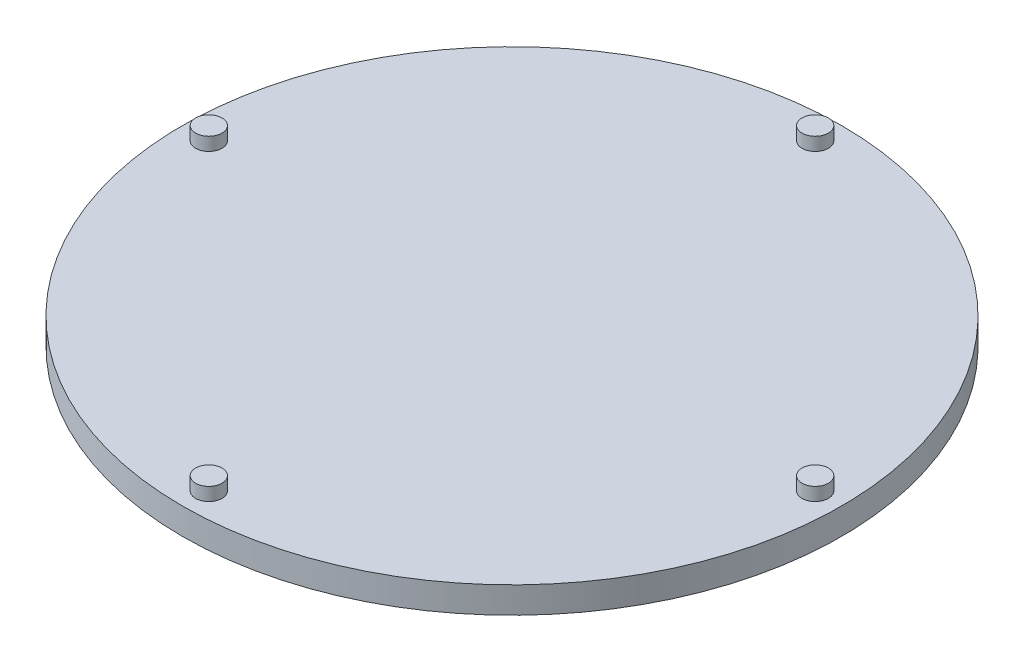
ISO-10303-21;
HEADER;
FILE_DESCRIPTION(('STEP AP214'),'2;1');
FILE_NAME('part.step','',(''),(''),'','','');
FILE_SCHEMA(('AUTOMOTIVE_DESIGN { 1 0 10303 214 1 1 1 1 }'));
ENDSEC;
DATA;
#1=APPLICATION_CONTEXT('core data for automotive mechanical design processes');
#2=APPLICATION_PROTOCOL_DEFINITION('international standard','automotive_design',2000,#1);
#3=PRODUCT_CONTEXT('',#1,'mechanical');
#4=PRODUCT('Part','Part','',(#3));
#5=PRODUCT_RELATED_PRODUCT_CATEGORY('part','',(#4));
#6=PRODUCT_DEFINITION_FORMATION('','',#4);
#7=PRODUCT_DEFINITION_CONTEXT('part definition',#1,'design');
#8=PRODUCT_DEFINITION('design','',#6,#7);
#9=PRODUCT_DEFINITION_SHAPE('','',#8);
#10=(LENGTH_UNIT() NAMED_UNIT(*) SI_UNIT(.MILLI.,.METRE.));
#11=(NAMED_UNIT(*) PLANE_ANGLE_UNIT() SI_UNIT($,.RADIAN.));
#12=(NAMED_UNIT(*) SI_UNIT($,.STERADIAN.) SOLID_ANGLE_UNIT());
#13=UNCERTAINTY_MEASURE_WITH_UNIT(LENGTH_MEASURE(1.E-05),#10,'distance_accuracy_value','');
#14=(GEOMETRIC_REPRESENTATION_CONTEXT(3) GLOBAL_UNCERTAINTY_ASSIGNED_CONTEXT((#13)) GLOBAL_UNIT_ASSIGNED_CONTEXT((#10,
#11,#12)) REPRESENTATION_CONTEXT('',''));
#15=CARTESIAN_POINT('',(0.,0.,0.));
#16=DIRECTION('',(0.,0.,1.));
#17=DIRECTION('',(1.,0.,0.));
#18=AXIS2_PLACEMENT_3D('',#15,#16,#17);
#19=CARTESIAN_POINT('',(0.,2.,0.));
#20=DIRECTION('',(0.,-1.,0.));
#21=DIRECTION('',(0.,0.,-1.));
#22=AXIS2_PLACEMENT_3D('',#19,#20,#21);
#23=CYLINDRICAL_SURFACE('',#22,25.);
#24=CARTESIAN_POINT('',(0.,2.,0.));
#25=DIRECTION('',(0.,1.,0.));
#26=DIRECTION('',(0.,0.,1.));
#27=AXIS2_PLACEMENT_3D('',#24,#25,#26);
#28=CIRCLE('',#27,25.);
#29=CARTESIAN_POINT('',(0.,2.,25.));
#30=VERTEX_POINT('',#29);
#31=EDGE_CURVE('E10',#30,#30,#28,.T.);
#32=ORIENTED_EDGE('',*,*,#31,.F.);
#33=EDGE_LOOP('',(#32));
#34=FACE_BOUND('',#33,.T.);
#35=CARTESIAN_POINT('',(0.,0.,0.));
#36=DIRECTION('',(0.,1.,0.));
#37=DIRECTION('',(0.,0.,1.));
#38=AXIS2_PLACEMENT_3D('',#35,#36,#37);
#39=CIRCLE('',#38,25.);
#40=CARTESIAN_POINT('',(0.,0.,25.));
#41=VERTEX_POINT('',#40);
#42=EDGE_CURVE('E33',#41,#41,#39,.T.);
#43=ORIENTED_EDGE('',*,*,#42,.T.);
#44=EDGE_LOOP('',(#43));
#45=FACE_BOUND('',#44,.T.);
#46=ADVANCED_FACE('F30',(#34,#45),#23,.T.);
#47=CARTESIAN_POINT('',(0.,2.,0.));
#48=DIRECTION('',(0.,1.,0.));
#49=DIRECTION('',(0.,0.,1.));
#50=AXIS2_PLACEMENT_3D('',#47,#48,#49);
#51=PLANE('',#50);
#52=CARTESIAN_POINT('',(-23.,2.,0.));
#53=DIRECTION('',(0.,1.,0.));
#54=DIRECTION('',(0.,0.,1.));
#55=AXIS2_PLACEMENT_3D('',#52,#53,#54);
#56=CIRCLE('',#55,1.);
#57=CARTESIAN_POINT('',(-23.,2.,1.));
#58=VERTEX_POINT('',#57);
#59=EDGE_CURVE('E60',#58,#58,#56,.T.);
#60=ORIENTED_EDGE('',*,*,#59,.F.);
#61=EDGE_LOOP('',(#60));
#62=FACE_BOUND('',#61,.T.);
#63=CARTESIAN_POINT('',(0.,2.,23.));
#64=DIRECTION('',(0.,1.,0.));
#65=DIRECTION('',(0.,0.,1.));
#66=AXIS2_PLACEMENT_3D('',#63,#64,#65);
#67=CIRCLE('',#66,1.);
#68=CARTESIAN_POINT('',(0.,2.,24.));
#69=VERTEX_POINT('',#68);
#70=EDGE_CURVE('E54',#69,#69,#67,.T.);
#71=ORIENTED_EDGE('',*,*,#70,.F.);
#72=EDGE_LOOP('',(#71));
#73=FACE_BOUND('',#72,.T.);
#74=CARTESIAN_POINT('',(23.,2.,0.));
#75=DIRECTION('',(0.,1.,0.));
#76=DIRECTION('',(0.,0.,1.));
#77=AXIS2_PLACEMENT_3D('',#74,#75,#76);
#78=CIRCLE('',#77,1.);
#79=CARTESIAN_POINT('',(23.,2.,1.));
#80=VERTEX_POINT('',#79);
#81=EDGE_CURVE('E48',#80,#80,#78,.T.);
#82=ORIENTED_EDGE('',*,*,#81,.F.);
#83=EDGE_LOOP('',(#82));
#84=FACE_BOUND('',#83,.T.);
#85=CARTESIAN_POINT('',(0.,2.,-23.));
#86=DIRECTION('',(0.,1.,0.));
#87=DIRECTION('',(0.,0.,1.));
#88=AXIS2_PLACEMENT_3D('',#85,#86,#87);
#89=CIRCLE('',#88,1.);
#90=CARTESIAN_POINT('',(0.,2.,-22.));
#91=VERTEX_POINT('',#90);
#92=EDGE_CURVE('E42',#91,#91,#89,.T.);
#93=ORIENTED_EDGE('',*,*,#92,.F.);
#94=EDGE_LOOP('',(#93));
#95=FACE_BOUND('',#94,.T.);
#96=ORIENTED_EDGE('',*,*,#31,.T.);
#97=EDGE_LOOP('',(#96));
#98=FACE_BOUND('',#97,.T.);
#99=ADVANCED_FACE('F75',(#62,#73,#84,#95,#98),#51,.T.);
#100=CARTESIAN_POINT('',(0.,0.,0.));
#101=DIRECTION('',(0.,1.,0.));
#102=DIRECTION('',(0.,0.,1.));
#103=AXIS2_PLACEMENT_3D('',#100,#101,#102);
#104=PLANE('',#103);
#105=ORIENTED_EDGE('',*,*,#42,.F.);
#106=EDGE_LOOP('',(#105));
#107=FACE_BOUND('',#106,.T.);
#108=ADVANCED_FACE('F78',(#107),#104,.F.);
#109=CARTESIAN_POINT('',(0.,3.,-23.));
#110=DIRECTION('',(0.,-1.,0.));
#111=DIRECTION('',(0.,0.,-1.));
#112=AXIS2_PLACEMENT_3D('',#109,#110,#111);
#113=CYLINDRICAL_SURFACE('',#112,1.);
#114=CARTESIAN_POINT('',(0.,3.,-23.));
#115=DIRECTION('',(0.,1.,0.));
#116=DIRECTION('',(0.,0.,1.));
#117=AXIS2_PLACEMENT_3D('',#114,#115,#116);
#118=CIRCLE('',#117,1.);
#119=CARTESIAN_POINT('',(0.,3.,-22.));
#120=VERTEX_POINT('',#119);
#121=EDGE_CURVE('E40',#120,#120,#118,.T.);
#122=ORIENTED_EDGE('',*,*,#121,.F.);
#123=EDGE_LOOP('',(#122));
#124=FACE_BOUND('',#123,.T.);
#125=ORIENTED_EDGE('',*,*,#92,.T.);
#126=EDGE_LOOP('',(#125));
#127=FACE_BOUND('',#126,.T.);
#128=ADVANCED_FACE('F86',(#124,#127),#113,.T.);
#129=CARTESIAN_POINT('',(0.,3.,-23.));
#130=DIRECTION('',(0.,1.,0.));
#131=DIRECTION('',(0.,0.,1.));
#132=AXIS2_PLACEMENT_3D('',#129,#130,#131);
#133=PLANE('',#132);
#134=ORIENTED_EDGE('',*,*,#121,.T.);
#135=EDGE_LOOP('',(#134));
#136=FACE_BOUND('',#135,.T.);
#137=ADVANCED_FACE('F88',(#136),#133,.T.);
#138=CARTESIAN_POINT('',(23.,3.,0.));
#139=DIRECTION('',(0.,-1.,0.));
#140=DIRECTION('',(0.,0.,-1.));
#141=AXIS2_PLACEMENT_3D('',#138,#139,#140);
#142=CYLINDRICAL_SURFACE('',#141,1.);
#143=CARTESIAN_POINT('',(23.,3.,0.));
#144=DIRECTION('',(0.,1.,0.));
#145=DIRECTION('',(0.,0.,1.));
#146=AXIS2_PLACEMENT_3D('',#143,#144,#145);
#147=CIRCLE('',#146,1.);
#148=CARTESIAN_POINT('',(23.,3.,1.));
#149=VERTEX_POINT('',#148);
#150=EDGE_CURVE('E45',#149,#149,#147,.T.);
#151=ORIENTED_EDGE('',*,*,#150,.F.);
#152=EDGE_LOOP('',(#151));
#153=FACE_BOUND('',#152,.T.);
#154=ORIENTED_EDGE('',*,*,#81,.T.);
#155=EDGE_LOOP('',(#154));
#156=FACE_BOUND('',#155,.T.);
#157=ADVANCED_FACE('F95',(#153,#156),#142,.T.);
#158=CARTESIAN_POINT('',(23.,3.,0.));
#159=DIRECTION('',(0.,1.,0.));
#160=DIRECTION('',(0.,0.,1.));
#161=AXIS2_PLACEMENT_3D('',#158,#159,#160);
#162=PLANE('',#161);
#163=ORIENTED_EDGE('',*,*,#150,.T.);
#164=EDGE_LOOP('',(#163));
#165=FACE_BOUND('',#164,.T.);
#166=ADVANCED_FACE('F135',(#165),#162,.T.);
#167=CARTESIAN_POINT('',(0.,3.,23.));
#168=DIRECTION('',(0.,-1.,0.));
#169=DIRECTION('',(0.,0.,-1.));
#170=AXIS2_PLACEMENT_3D('',#167,#168,#169);
#171=CYLINDRICAL_SURFACE('',#170,1.);
#172=CARTESIAN_POINT('',(0.,3.,23.));
#173=DIRECTION('',(0.,1.,0.));
#174=DIRECTION('',(0.,0.,1.));
#175=AXIS2_PLACEMENT_3D('',#172,#173,#174);
#176=CIRCLE('',#175,1.);
#177=CARTESIAN_POINT('',(0.,3.,24.));
#178=VERTEX_POINT('',#177);
#179=EDGE_CURVE('E51',#178,#178,#176,.T.);
#180=ORIENTED_EDGE('',*,*,#179,.F.);
#181=EDGE_LOOP('',(#180));
#182=FACE_BOUND('',#181,.T.);
#183=ORIENTED_EDGE('',*,*,#70,.T.);
#184=EDGE_LOOP('',(#183));
#185=FACE_BOUND('',#184,.T.);
#186=ADVANCED_FACE('F144',(#182,#185),#171,.T.);
#187=CARTESIAN_POINT('',(0.,3.,23.));
#188=DIRECTION('',(0.,1.,0.));
#189=DIRECTION('',(0.,0.,1.));
#190=AXIS2_PLACEMENT_3D('',#187,#188,#189);
#191=PLANE('',#190);
#192=ORIENTED_EDGE('',*,*,#179,.T.);
#193=EDGE_LOOP('',(#192));
#194=FACE_BOUND('',#193,.T.);
#195=ADVANCED_FACE('F71',(#194),#191,.T.);
#196=CARTESIAN_POINT('',(-23.,3.,0.));
#197=DIRECTION('',(0.,-1.,0.));
#198=DIRECTION('',(0.,0.,-1.));
#199=AXIS2_PLACEMENT_3D('',#196,#197,#198);
#200=CYLINDRICAL_SURFACE('',#199,1.);
#201=CARTESIAN_POINT('',(-23.,3.,0.));
#202=DIRECTION('',(0.,1.,0.));
#203=DIRECTION('',(0.,0.,1.));
#204=AXIS2_PLACEMENT_3D('',#201,#202,#203);
#205=CIRCLE('',#204,1.);
#206=CARTESIAN_POINT('',(-23.,3.,1.));
#207=VERTEX_POINT('',#206);
#208=EDGE_CURVE('E57',#207,#207,#205,.T.);
#209=ORIENTED_EDGE('',*,*,#208,.F.);
#210=EDGE_LOOP('',(#209));
#211=FACE_BOUND('',#210,.T.);
#212=ORIENTED_EDGE('',*,*,#59,.T.);
#213=EDGE_LOOP('',(#212));
#214=FACE_BOUND('',#213,.T.);
#215=ADVANCED_FACE('F68',(#211,#214),#200,.T.);
#216=CARTESIAN_POINT('',(-23.,3.,0.));
#217=DIRECTION('',(0.,1.,0.));
#218=DIRECTION('',(0.,0.,1.));
#219=AXIS2_PLACEMENT_3D('',#216,#217,#218);
#220=PLANE('',#219);
#221=ORIENTED_EDGE('',*,*,#208,.T.);
#222=EDGE_LOOP('',(#221));
#223=FACE_BOUND('',#222,.T.);
#224=ADVANCED_FACE('F66',(#223),#220,.T.);
#225=CLOSED_SHELL('',(#46,#99,#108,#128,#137,#157,#166,#186,#195,#215,#224));
#226=MANIFOLD_SOLID_BREP('B2',#225);
#227=ADVANCED_BREP_SHAPE_REPRESENTATION('',(#18,#226),#14);
#228=SHAPE_DEFINITION_REPRESENTATION(#9,#227);
ENDSEC;
END-ISO-10303-21;
